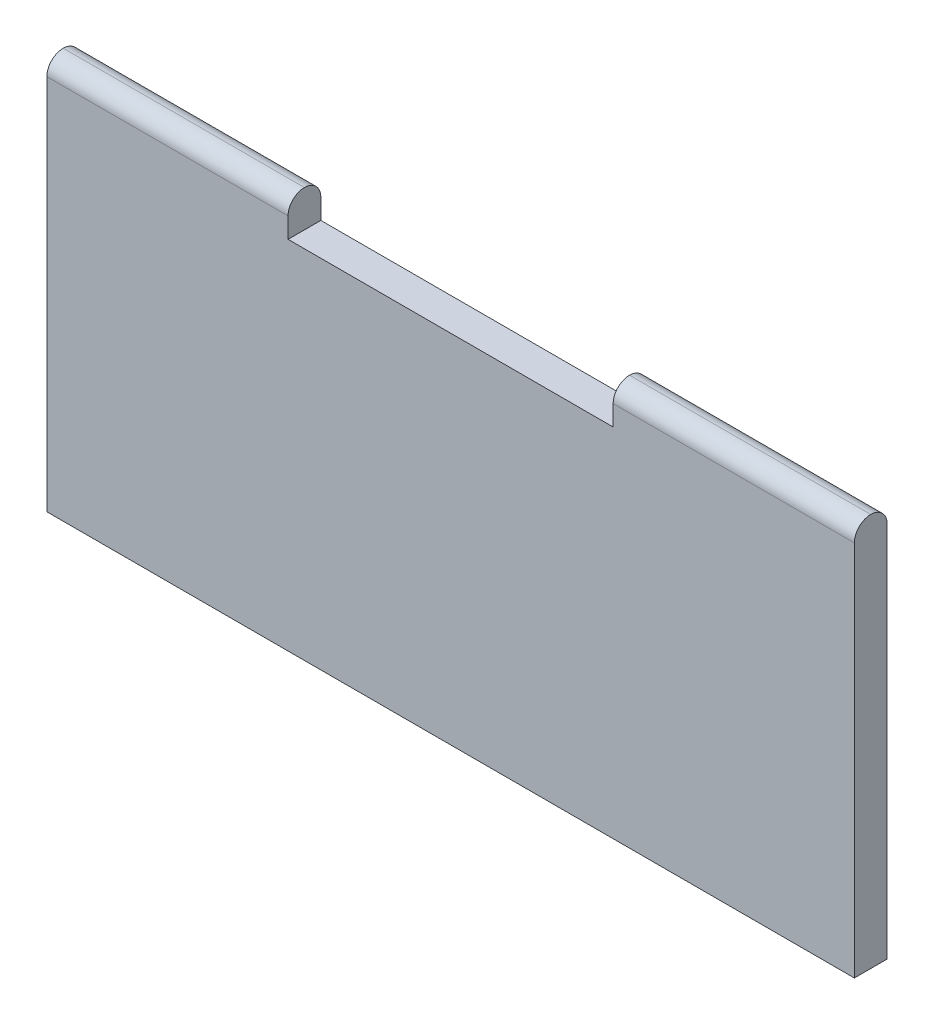
ISO-10303-21;
HEADER;
FILE_DESCRIPTION(('STEP AP214'),'2;1');
FILE_NAME('part.step','',(''),(''),'','','');
FILE_SCHEMA(('AUTOMOTIVE_DESIGN { 1 0 10303 214 1 1 1 1 }'));
ENDSEC;
DATA;
#1=APPLICATION_CONTEXT('core data for automotive mechanical design processes');
#2=APPLICATION_PROTOCOL_DEFINITION('international standard','automotive_design',2000,#1);
#3=PRODUCT_CONTEXT('',#1,'mechanical');
#4=PRODUCT('Part','Part','',(#3));
#5=PRODUCT_RELATED_PRODUCT_CATEGORY('part','',(#4));
#6=PRODUCT_DEFINITION_FORMATION('','',#4);
#7=PRODUCT_DEFINITION_CONTEXT('part definition',#1,'design');
#8=PRODUCT_DEFINITION('design','',#6,#7);
#9=PRODUCT_DEFINITION_SHAPE('','',#8);
#10=(LENGTH_UNIT() NAMED_UNIT(*) SI_UNIT(.MILLI.,.METRE.));
#11=(NAMED_UNIT(*) PLANE_ANGLE_UNIT() SI_UNIT($,.RADIAN.));
#12=(NAMED_UNIT(*) SI_UNIT($,.STERADIAN.) SOLID_ANGLE_UNIT());
#13=UNCERTAINTY_MEASURE_WITH_UNIT(LENGTH_MEASURE(1.E-05),#10,'distance_accuracy_value','');
#14=(GEOMETRIC_REPRESENTATION_CONTEXT(3) GLOBAL_UNCERTAINTY_ASSIGNED_CONTEXT((#13)) GLOBAL_UNIT_ASSIGNED_CONTEXT((#10,
#11,#12)) REPRESENTATION_CONTEXT('',''));
#15=CARTESIAN_POINT('',(0.,0.,0.));
#16=DIRECTION('',(0.,0.,1.));
#17=DIRECTION('',(1.,0.,0.));
#18=AXIS2_PLACEMENT_3D('',#15,#16,#17);
#19=CARTESIAN_POINT('',(0.,143.75,6.25));
#20=DIRECTION('',(-1.,0.,0.));
#21=DIRECTION('',(0.,0.,1.));
#22=AXIS2_PLACEMENT_3D('',#19,#20,#21);
#23=CYLINDRICAL_SURFACE('',#22,6.25);
#24=CARTESIAN_POINT('',(216.,143.75,6.25));
#25=DIRECTION('',(1.,0.,0.));
#26=DIRECTION('',(0.,0.,-1.));
#27=AXIS2_PLACEMENT_3D('',#24,#25,#26);
#28=CIRCLE('',#27,6.25);
#29=CARTESIAN_POINT('',(216.,143.75,12.5));
#30=VERTEX_POINT('',#29);
#31=CARTESIAN_POINT('',(216.,150.,6.25));
#32=VERTEX_POINT('',#31);
#33=EDGE_CURVE('E138',#30,#32,#28,.F.);
#34=ORIENTED_EDGE('',*,*,#33,.F.);
#35=DIRECTION('',(-1.,0.,0.));
#36=VECTOR('',#35,1.);
#37=CARTESIAN_POINT('',(0.,143.75,12.5));
#38=LINE('',#37,#36);
#39=CARTESIAN_POINT('',(308.,143.75,12.5));
#40=VERTEX_POINT('',#39);
#41=EDGE_CURVE('E165',#40,#30,#38,.T.);
#42=ORIENTED_EDGE('',*,*,#41,.F.);
#43=CARTESIAN_POINT('',(308.,143.75,6.25));
#44=DIRECTION('',(-1.,0.,0.));
#45=DIRECTION('',(0.,0.,1.));
#46=AXIS2_PLACEMENT_3D('',#43,#44,#45);
#47=CIRCLE('',#46,6.25);
#48=CARTESIAN_POINT('',(308.,150.,6.25));
#49=VERTEX_POINT('',#48);
#50=EDGE_CURVE('E175',#49,#40,#47,.F.);
#51=ORIENTED_EDGE('',*,*,#50,.F.);
#52=DIRECTION('',(-1.,0.,0.));
#53=VECTOR('',#52,1.);
#54=CARTESIAN_POINT('',(0.,150.,6.25));
#55=LINE('',#54,#53);
#56=EDGE_CURVE('E171',#32,#49,#55,.F.);
#57=ORIENTED_EDGE('',*,*,#56,.F.);
#58=EDGE_LOOP('',(#34,#42,#51,#57));
#59=FACE_BOUND('',#58,.T.);
#60=ADVANCED_FACE('F34',(#59),#23,.T.);
#61=CARTESIAN_POINT('',(0.,143.75,6.25));
#62=DIRECTION('',(1.,0.,0.));
#63=DIRECTION('',(0.,0.,-1.));
#64=AXIS2_PLACEMENT_3D('',#61,#62,#63);
#65=CYLINDRICAL_SURFACE('',#64,6.25);
#66=CARTESIAN_POINT('',(216.,143.75,6.25));
#67=DIRECTION('',(1.,0.,0.));
#68=DIRECTION('',(0.,0.,-1.));
#69=AXIS2_PLACEMENT_3D('',#66,#67,#68);
#70=CIRCLE('',#69,6.25);
#71=CARTESIAN_POINT('',(216.,143.75,0.));
#72=VERTEX_POINT('',#71);
#73=EDGE_CURVE('E11',#32,#72,#70,.F.);
#74=ORIENTED_EDGE('',*,*,#73,.F.);
#75=ORIENTED_EDGE('',*,*,#56,.T.);
#76=CARTESIAN_POINT('',(308.,143.75,6.25));
#77=DIRECTION('',(-1.,0.,0.));
#78=DIRECTION('',(0.,0.,1.));
#79=AXIS2_PLACEMENT_3D('',#76,#77,#78);
#80=CIRCLE('',#79,6.25);
#81=CARTESIAN_POINT('',(308.,143.75,0.));
#82=VERTEX_POINT('',#81);
#83=EDGE_CURVE('E180',#82,#49,#80,.F.);
#84=ORIENTED_EDGE('',*,*,#83,.F.);
#85=DIRECTION('',(-1.,0.,0.));
#86=VECTOR('',#85,1.);
#87=CARTESIAN_POINT('',(308.,143.75,0.));
#88=LINE('',#87,#86);
#89=EDGE_CURVE('E57',#72,#82,#88,.F.);
#90=ORIENTED_EDGE('',*,*,#89,.F.);
#91=EDGE_LOOP('',(#74,#75,#84,#90));
#92=FACE_BOUND('',#91,.T.);
#93=ADVANCED_FACE('F212',(#92),#65,.T.);
#94=CARTESIAN_POINT('',(0.,0.,12.5));
#95=DIRECTION('',(1.,0.,0.));
#96=DIRECTION('',(0.,0.,-1.));
#97=AXIS2_PLACEMENT_3D('',#94,#95,#96);
#98=PLANE('',#97);
#99=CARTESIAN_POINT('',(0.,143.75,6.25));
#100=DIRECTION('',(1.,0.,0.));
#101=DIRECTION('',(0.,0.,-1.));
#102=AXIS2_PLACEMENT_3D('',#99,#100,#101);
#103=CIRCLE('',#102,6.25);
#104=CARTESIAN_POINT('',(0.,143.75,12.5));
#105=VERTEX_POINT('',#104);
#106=CARTESIAN_POINT('',(0.,150.,6.25));
#107=VERTEX_POINT('',#106);
#108=EDGE_CURVE('E168',#105,#107,#103,.F.);
#109=ORIENTED_EDGE('',*,*,#108,.T.);
#110=CARTESIAN_POINT('',(0.,143.75,6.25));
#111=DIRECTION('',(1.,0.,0.));
#112=DIRECTION('',(0.,0.,-1.));
#113=AXIS2_PLACEMENT_3D('',#110,#111,#112);
#114=CIRCLE('',#113,6.25);
#115=CARTESIAN_POINT('',(0.,143.75,0.));
#116=VERTEX_POINT('',#115);
#117=EDGE_CURVE('E177',#107,#116,#114,.F.);
#118=ORIENTED_EDGE('',*,*,#117,.T.);
#119=DIRECTION('',(0.,-1.,0.));
#120=VECTOR('',#119,1.);
#121=CARTESIAN_POINT('',(0.,0.,0.));
#122=LINE('',#121,#120);
#123=CARTESIAN_POINT('',(0.,0.,0.));
#124=VERTEX_POINT('',#123);
#125=EDGE_CURVE('E145',#116,#124,#122,.T.);
#126=ORIENTED_EDGE('',*,*,#125,.T.);
#127=DIRECTION('',(0.,0.,-1.));
#128=VECTOR('',#127,1.);
#129=CARTESIAN_POINT('',(0.,0.,12.5));
#130=LINE('',#129,#128);
#131=CARTESIAN_POINT('',(0.,0.,12.5));
#132=VERTEX_POINT('',#131);
#133=EDGE_CURVE('E161',#132,#124,#130,.T.);
#134=ORIENTED_EDGE('',*,*,#133,.F.);
#135=DIRECTION('',(0.,-1.,0.));
#136=VECTOR('',#135,1.);
#137=CARTESIAN_POINT('',(0.,0.,12.5));
#138=LINE('',#137,#136);
#139=EDGE_CURVE('E146',#105,#132,#138,.T.);
#140=ORIENTED_EDGE('',*,*,#139,.F.);
#141=EDGE_LOOP('',(#109,#118,#126,#134,#140));
#142=FACE_BOUND('',#141,.T.);
#143=ADVANCED_FACE('F191',(#142),#98,.F.);
#144=CARTESIAN_POINT('',(0.,0.,12.5));
#145=DIRECTION('',(0.,1.,0.));
#146=DIRECTION('',(0.,0.,1.));
#147=AXIS2_PLACEMENT_3D('',#144,#145,#146);
#148=PLANE('',#147);
#149=DIRECTION('',(1.,0.,0.));
#150=VECTOR('',#149,1.);
#151=CARTESIAN_POINT('',(0.,0.,0.));
#152=LINE('',#151,#150);
#153=CARTESIAN_POINT('',(308.,0.,0.));
#154=VERTEX_POINT('',#153);
#155=EDGE_CURVE('E156',#124,#154,#152,.T.);
#156=ORIENTED_EDGE('',*,*,#155,.T.);
#157=DIRECTION('',(0.,0.,-1.));
#158=VECTOR('',#157,1.);
#159=CARTESIAN_POINT('',(308.,0.,12.5));
#160=LINE('',#159,#158);
#161=CARTESIAN_POINT('',(308.,0.,12.5));
#162=VERTEX_POINT('',#161);
#163=EDGE_CURVE('E154',#162,#154,#160,.T.);
#164=ORIENTED_EDGE('',*,*,#163,.F.);
#165=DIRECTION('',(1.,0.,0.));
#166=VECTOR('',#165,1.);
#167=CARTESIAN_POINT('',(0.,0.,12.5));
#168=LINE('',#167,#166);
#169=EDGE_CURVE('E148',#132,#162,#168,.T.);
#170=ORIENTED_EDGE('',*,*,#169,.F.);
#171=ORIENTED_EDGE('',*,*,#133,.T.);
#172=EDGE_LOOP('',(#156,#164,#170,#171));
#173=FACE_BOUND('',#172,.T.);
#174=ADVANCED_FACE('F198',(#173),#148,.F.);
#175=CARTESIAN_POINT('',(308.,0.,12.5));
#176=DIRECTION('',(-1.,0.,0.));
#177=DIRECTION('',(0.,0.,1.));
#178=AXIS2_PLACEMENT_3D('',#175,#176,#177);
#179=PLANE('',#178);
#180=DIRECTION('',(0.,1.,0.));
#181=VECTOR('',#180,1.);
#182=CARTESIAN_POINT('',(308.,0.,0.));
#183=LINE('',#182,#181);
#184=EDGE_CURVE('E149',#154,#82,#183,.T.);
#185=ORIENTED_EDGE('',*,*,#184,.T.);
#186=ORIENTED_EDGE('',*,*,#83,.T.);
#187=ORIENTED_EDGE('',*,*,#50,.T.);
#188=DIRECTION('',(0.,1.,0.));
#189=VECTOR('',#188,1.);
#190=CARTESIAN_POINT('',(308.,0.,12.5));
#191=LINE('',#190,#189);
#192=EDGE_CURVE('E151',#162,#40,#191,.T.);
#193=ORIENTED_EDGE('',*,*,#192,.F.);
#194=ORIENTED_EDGE('',*,*,#163,.T.);
#195=EDGE_LOOP('',(#185,#186,#187,#193,#194));
#196=FACE_BOUND('',#195,.T.);
#197=ADVANCED_FACE('F202',(#196),#179,.F.);
#198=CARTESIAN_POINT('',(0.,0.,12.5));
#199=DIRECTION('',(0.,0.,-1.));
#200=DIRECTION('',(-1.,0.,0.));
#201=AXIS2_PLACEMENT_3D('',#198,#199,#200);
#202=PLANE('',#201);
#203=ORIENTED_EDGE('',*,*,#41,.T.);
#204=DIRECTION('',(0.,-1.,0.));
#205=VECTOR('',#204,1.);
#206=CARTESIAN_POINT('',(216.,0.,12.5));
#207=LINE('',#206,#205);
#208=CARTESIAN_POINT('',(216.,136.,12.5));
#209=VERTEX_POINT('',#208);
#210=EDGE_CURVE('E140',#30,#209,#207,.T.);
#211=ORIENTED_EDGE('',*,*,#210,.T.);
#212=DIRECTION('',(-1.,0.,0.));
#213=VECTOR('',#212,1.);
#214=CARTESIAN_POINT('',(0.,136.,12.5));
#215=LINE('',#214,#213);
#216=CARTESIAN_POINT('',(92.,136.,12.5));
#217=VERTEX_POINT('',#216);
#218=EDGE_CURVE('E143',#209,#217,#215,.T.);
#219=ORIENTED_EDGE('',*,*,#218,.T.);
#220=DIRECTION('',(0.,1.,0.));
#221=VECTOR('',#220,1.);
#222=CARTESIAN_POINT('',(92.,0.,12.5));
#223=LINE('',#222,#221);
#224=CARTESIAN_POINT('',(92.,143.75,12.5));
#225=VERTEX_POINT('',#224);
#226=EDGE_CURVE('E114',#217,#225,#223,.T.);
#227=ORIENTED_EDGE('',*,*,#226,.T.);
#228=EDGE_CURVE('E164',#225,#105,#38,.T.);
#229=ORIENTED_EDGE('',*,*,#228,.T.);
#230=ORIENTED_EDGE('',*,*,#139,.T.);
#231=ORIENTED_EDGE('',*,*,#169,.T.);
#232=ORIENTED_EDGE('',*,*,#192,.T.);
#233=EDGE_LOOP('',(#203,#211,#219,#227,#229,#230,#231,#232));
#234=FACE_BOUND('',#233,.T.);
#235=ADVANCED_FACE('F195',(#234),#202,.F.);
#236=CARTESIAN_POINT('',(0.,0.,0.));
#237=DIRECTION('',(0.,0.,-1.));
#238=DIRECTION('',(-1.,0.,0.));
#239=AXIS2_PLACEMENT_3D('',#236,#237,#238);
#240=PLANE('',#239);
#241=DIRECTION('',(0.,-1.,0.));
#242=VECTOR('',#241,1.);
#243=CARTESIAN_POINT('',(216.,136.,0.));
#244=LINE('',#243,#242);
#245=CARTESIAN_POINT('',(216.,136.,0.));
#246=VERTEX_POINT('',#245);
#247=EDGE_CURVE('E118',#72,#246,#244,.T.);
#248=ORIENTED_EDGE('',*,*,#247,.F.);
#249=ORIENTED_EDGE('',*,*,#89,.T.);
#250=ORIENTED_EDGE('',*,*,#184,.F.);
#251=ORIENTED_EDGE('',*,*,#155,.F.);
#252=ORIENTED_EDGE('',*,*,#125,.F.);
#253=CARTESIAN_POINT('',(92.,143.75,0.));
#254=VERTEX_POINT('',#253);
#255=EDGE_CURVE('E130',#116,#254,#88,.F.);
#256=ORIENTED_EDGE('',*,*,#255,.T.);
#257=DIRECTION('',(0.,1.,0.));
#258=VECTOR('',#257,1.);
#259=CARTESIAN_POINT('',(92.,165.928579255671,0.));
#260=LINE('',#259,#258);
#261=CARTESIAN_POINT('',(92.,136.,0.));
#262=VERTEX_POINT('',#261);
#263=EDGE_CURVE('E49',#262,#254,#260,.T.);
#264=ORIENTED_EDGE('',*,*,#263,.F.);
#265=DIRECTION('',(-1.,0.,0.));
#266=VECTOR('',#265,1.);
#267=CARTESIAN_POINT('',(154.,136.,0.));
#268=LINE('',#267,#266);
#269=EDGE_CURVE('E121',#246,#262,#268,.T.);
#270=ORIENTED_EDGE('',*,*,#269,.F.);
#271=EDGE_LOOP('',(#248,#249,#250,#251,#252,#256,#264,#270));
#272=FACE_BOUND('',#271,.T.);
#273=ADVANCED_FACE('F127',(#272),#240,.T.);
#274=CARTESIAN_POINT('',(92.,143.75,6.25));
#275=DIRECTION('',(-1.,0.,0.));
#276=DIRECTION('',(0.,0.,1.));
#277=AXIS2_PLACEMENT_3D('',#274,#275,#276);
#278=CIRCLE('',#277,6.25);
#279=CARTESIAN_POINT('',(92.,150.,6.25));
#280=VERTEX_POINT('',#279);
#281=EDGE_CURVE('E134',#280,#225,#278,.F.);
#282=ORIENTED_EDGE('',*,*,#281,.F.);
#283=EDGE_CURVE('E172',#107,#280,#55,.F.);
#284=ORIENTED_EDGE('',*,*,#283,.F.);
#285=ORIENTED_EDGE('',*,*,#108,.F.);
#286=ORIENTED_EDGE('',*,*,#228,.F.);
#287=EDGE_LOOP('',(#282,#284,#285,#286));
#288=FACE_BOUND('',#287,.T.);
#289=ADVANCED_FACE('F187',(#288),#23,.T.);
#290=CARTESIAN_POINT('',(92.,143.75,6.25));
#291=DIRECTION('',(-1.,0.,0.));
#292=DIRECTION('',(0.,0.,1.));
#293=AXIS2_PLACEMENT_3D('',#290,#291,#292);
#294=CIRCLE('',#293,6.25);
#295=EDGE_CURVE('E42',#254,#280,#294,.F.);
#296=ORIENTED_EDGE('',*,*,#295,.F.);
#297=ORIENTED_EDGE('',*,*,#255,.F.);
#298=ORIENTED_EDGE('',*,*,#117,.F.);
#299=ORIENTED_EDGE('',*,*,#283,.T.);
#300=EDGE_LOOP('',(#296,#297,#298,#299));
#301=FACE_BOUND('',#300,.T.);
#302=ADVANCED_FACE('F36',(#301),#65,.T.);
#303=CARTESIAN_POINT('',(154.,136.,44.));
#304=DIRECTION('',(0.,-1.,0.));
#305=DIRECTION('',(0.,0.,-1.));
#306=AXIS2_PLACEMENT_3D('',#303,#304,#305);
#307=PLANE('',#306);
#308=DIRECTION('',(0.,0.,-1.));
#309=VECTOR('',#308,1.);
#310=CARTESIAN_POINT('',(216.,136.,44.));
#311=LINE('',#310,#309);
#312=EDGE_CURVE('E117',#209,#246,#311,.T.);
#313=ORIENTED_EDGE('',*,*,#312,.T.);
#314=ORIENTED_EDGE('',*,*,#269,.T.);
#315=DIRECTION('',(0.,0.,-1.));
#316=VECTOR('',#315,1.);
#317=CARTESIAN_POINT('',(92.,136.,44.));
#318=LINE('',#317,#316);
#319=EDGE_CURVE('E110',#217,#262,#318,.T.);
#320=ORIENTED_EDGE('',*,*,#319,.F.);
#321=ORIENTED_EDGE('',*,*,#218,.F.);
#322=EDGE_LOOP('',(#313,#314,#320,#321));
#323=FACE_BOUND('',#322,.T.);
#324=ADVANCED_FACE('F122',(#323),#307,.F.);
#325=CARTESIAN_POINT('',(216.,136.,44.));
#326=DIRECTION('',(1.,0.,0.));
#327=DIRECTION('',(0.,0.,-1.));
#328=AXIS2_PLACEMENT_3D('',#325,#326,#327);
#329=PLANE('',#328);
#330=ORIENTED_EDGE('',*,*,#33,.T.);
#331=ORIENTED_EDGE('',*,*,#73,.T.);
#332=ORIENTED_EDGE('',*,*,#247,.T.);
#333=ORIENTED_EDGE('',*,*,#312,.F.);
#334=ORIENTED_EDGE('',*,*,#210,.F.);
#335=EDGE_LOOP('',(#330,#331,#332,#333,#334));
#336=FACE_BOUND('',#335,.T.);
#337=ADVANCED_FACE('F210',(#336),#329,.F.);
#338=CARTESIAN_POINT('',(92.,165.928579255671,44.));
#339=DIRECTION('',(-1.,0.,0.));
#340=DIRECTION('',(0.,0.,1.));
#341=AXIS2_PLACEMENT_3D('',#338,#339,#340);
#342=PLANE('',#341);
#343=ORIENTED_EDGE('',*,*,#319,.T.);
#344=ORIENTED_EDGE('',*,*,#263,.T.);
#345=ORIENTED_EDGE('',*,*,#295,.T.);
#346=ORIENTED_EDGE('',*,*,#281,.T.);
#347=ORIENTED_EDGE('',*,*,#226,.F.);
#348=EDGE_LOOP('',(#343,#344,#345,#346,#347));
#349=FACE_BOUND('',#348,.T.);
#350=ADVANCED_FACE('F112',(#349),#342,.F.);
#351=CLOSED_SHELL('',(#60,#93,#143,#174,#197,#235,#273,#289,#302,#324,#337,#350));
#352=MANIFOLD_SOLID_BREP('B2',#351);
#353=ADVANCED_BREP_SHAPE_REPRESENTATION('',(#18,#352),#14);
#354=SHAPE_DEFINITION_REPRESENTATION(#9,#353);
ENDSEC;
END-ISO-10303-21;
